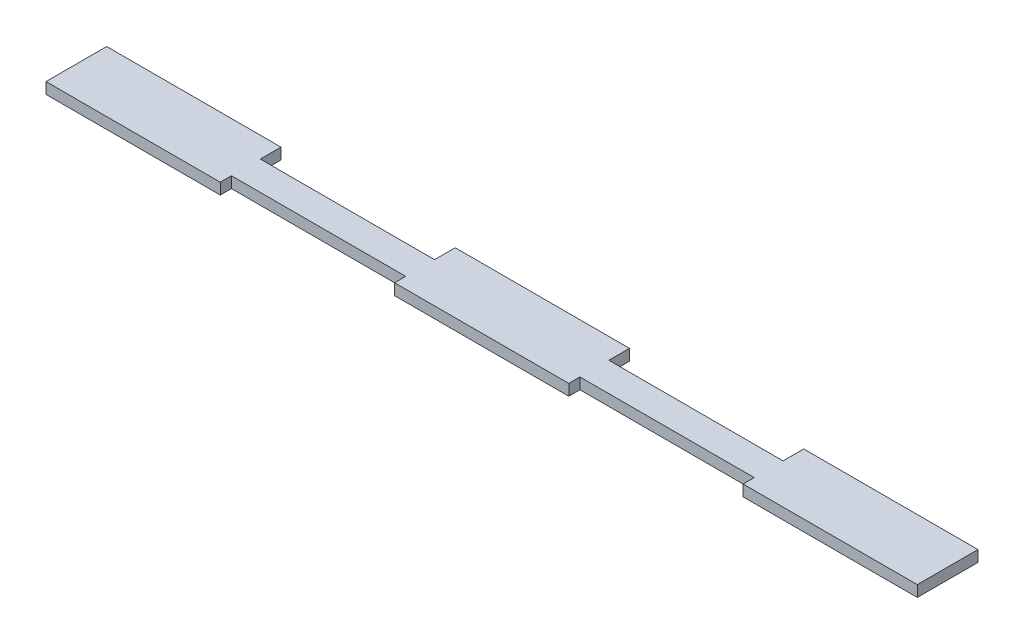
ISO-10303-21;
HEADER;
FILE_DESCRIPTION(('STEP AP214'),'2;1');
FILE_NAME('part.step','',(''),(''),'','','');
FILE_SCHEMA(('AUTOMOTIVE_DESIGN { 1 0 10303 214 1 1 1 1 }'));
ENDSEC;
DATA;
#1=APPLICATION_CONTEXT('core data for automotive mechanical design processes');
#2=APPLICATION_PROTOCOL_DEFINITION('international standard','automotive_design',2000,#1);
#3=PRODUCT_CONTEXT('',#1,'mechanical');
#4=PRODUCT('Part','Part','',(#3));
#5=PRODUCT_RELATED_PRODUCT_CATEGORY('part','',(#4));
#6=PRODUCT_DEFINITION_FORMATION('','',#4);
#7=PRODUCT_DEFINITION_CONTEXT('part definition',#1,'design');
#8=PRODUCT_DEFINITION('design','',#6,#7);
#9=PRODUCT_DEFINITION_SHAPE('','',#8);
#10=(LENGTH_UNIT() NAMED_UNIT(*) SI_UNIT(.MILLI.,.METRE.));
#11=(NAMED_UNIT(*) PLANE_ANGLE_UNIT() SI_UNIT($,.RADIAN.));
#12=(NAMED_UNIT(*) SI_UNIT($,.STERADIAN.) SOLID_ANGLE_UNIT());
#13=UNCERTAINTY_MEASURE_WITH_UNIT(LENGTH_MEASURE(1.E-05),#10,'distance_accuracy_value','');
#14=(GEOMETRIC_REPRESENTATION_CONTEXT(3) GLOBAL_UNCERTAINTY_ASSIGNED_CONTEXT((#13)) GLOBAL_UNIT_ASSIGNED_CONTEXT((#10,
#11,#12)) REPRESENTATION_CONTEXT('',''));
#15=CARTESIAN_POINT('',(0.,0.,0.));
#16=DIRECTION('',(0.,0.,1.));
#17=DIRECTION('',(1.,0.,0.));
#18=AXIS2_PLACEMENT_3D('',#15,#16,#17);
#19=CARTESIAN_POINT('',(63.3,2.7,6.01242319993023));
#20=DIRECTION('',(0.,0.,-1.));
#21=DIRECTION('',(-1.,0.,0.));
#22=AXIS2_PLACEMENT_3D('',#19,#20,#21);
#23=PLANE('',#22);
#24=DIRECTION('',(1.,0.,0.));
#25=VECTOR('',#24,1.);
#26=CARTESIAN_POINT('',(63.3,0.,6.01242319993023));
#27=LINE('',#26,#25);
#28=CARTESIAN_POINT('',(63.3,0.,6.01242319993023));
#29=VERTEX_POINT('',#28);
#30=CARTESIAN_POINT('',(105.5,0.,6.01242319993023));
#31=VERTEX_POINT('',#30);
#32=EDGE_CURVE('E201',#29,#31,#27,.T.);
#33=ORIENTED_EDGE('',*,*,#32,.T.);
#34=DIRECTION('',(0.,-1.,0.));
#35=VECTOR('',#34,1.);
#36=CARTESIAN_POINT('',(105.5,2.7,6.01242319993023));
#37=LINE('',#36,#35);
#38=CARTESIAN_POINT('',(105.5,2.7,6.01242319993023));
#39=VERTEX_POINT('',#38);
#40=EDGE_CURVE('E11',#39,#31,#37,.T.);
#41=ORIENTED_EDGE('',*,*,#40,.F.);
#42=DIRECTION('',(1.,0.,0.));
#43=VECTOR('',#42,1.);
#44=CARTESIAN_POINT('',(63.3,2.7,6.01242319993023));
#45=LINE('',#44,#43);
#46=CARTESIAN_POINT('',(63.3,2.7,6.01242319993023));
#47=VERTEX_POINT('',#46);
#48=EDGE_CURVE('E239',#47,#39,#45,.T.);
#49=ORIENTED_EDGE('',*,*,#48,.F.);
#50=DIRECTION('',(0.,-1.,0.));
#51=VECTOR('',#50,1.);
#52=CARTESIAN_POINT('',(63.3,2.7,6.01242319993023));
#53=LINE('',#52,#51);
#54=EDGE_CURVE('E197',#47,#29,#53,.T.);
#55=ORIENTED_EDGE('',*,*,#54,.T.);
#56=EDGE_LOOP('',(#33,#41,#49,#55));
#57=FACE_BOUND('',#56,.T.);
#58=ADVANCED_FACE('F33',(#57),#23,.F.);
#59=CARTESIAN_POINT('',(105.5,2.7,-8.68757680006977));
#60=DIRECTION('',(-1.,0.,0.));
#61=DIRECTION('',(0.,0.,1.));
#62=AXIS2_PLACEMENT_3D('',#59,#60,#61);
#63=PLANE('',#62);
#64=DIRECTION('',(0.,0.,-1.));
#65=VECTOR('',#64,1.);
#66=CARTESIAN_POINT('',(105.5,0.,-8.68757680006977));
#67=LINE('',#66,#65);
#68=CARTESIAN_POINT('',(105.5,0.,-8.68757680006977));
#69=VERTEX_POINT('',#68);
#70=EDGE_CURVE('E204',#31,#69,#67,.T.);
#71=ORIENTED_EDGE('',*,*,#70,.T.);
#72=DIRECTION('',(0.,-1.,0.));
#73=VECTOR('',#72,1.);
#74=CARTESIAN_POINT('',(105.5,2.7,-8.68757680006977));
#75=LINE('',#74,#73);
#76=CARTESIAN_POINT('',(105.5,2.7,-8.68757680006977));
#77=VERTEX_POINT('',#76);
#78=EDGE_CURVE('E41',#77,#69,#75,.T.);
#79=ORIENTED_EDGE('',*,*,#78,.F.);
#80=DIRECTION('',(0.,0.,-1.));
#81=VECTOR('',#80,1.);
#82=CARTESIAN_POINT('',(105.5,2.7,-8.68757680006977));
#83=LINE('',#82,#81);
#84=EDGE_CURVE('E128',#39,#77,#83,.T.);
#85=ORIENTED_EDGE('',*,*,#84,.F.);
#86=ORIENTED_EDGE('',*,*,#40,.T.);
#87=EDGE_LOOP('',(#71,#79,#85,#86));
#88=FACE_BOUND('',#87,.T.);
#89=ADVANCED_FACE('F357',(#88),#63,.F.);
#90=CARTESIAN_POINT('',(63.3,2.7,-8.68757680006977));
#91=DIRECTION('',(0.,0.,1.));
#92=DIRECTION('',(1.,0.,0.));
#93=AXIS2_PLACEMENT_3D('',#90,#91,#92);
#94=PLANE('',#93);
#95=DIRECTION('',(-1.,0.,0.));
#96=VECTOR('',#95,1.);
#97=CARTESIAN_POINT('',(63.3,0.,-8.68757680006977));
#98=LINE('',#97,#96);
#99=CARTESIAN_POINT('',(63.3,0.,-8.68757680006977));
#100=VERTEX_POINT('',#99);
#101=EDGE_CURVE('E206',#69,#100,#98,.T.);
#102=ORIENTED_EDGE('',*,*,#101,.T.);
#103=DIRECTION('',(0.,-1.,0.));
#104=VECTOR('',#103,1.);
#105=CARTESIAN_POINT('',(63.3,2.7,-8.68757680006977));
#106=LINE('',#105,#104);
#107=CARTESIAN_POINT('',(63.3,2.7,-8.68757680006977));
#108=VERTEX_POINT('',#107);
#109=EDGE_CURVE('E282',#108,#100,#106,.T.);
#110=ORIENTED_EDGE('',*,*,#109,.F.);
#111=DIRECTION('',(-1.,0.,0.));
#112=VECTOR('',#111,1.);
#113=CARTESIAN_POINT('',(63.3,2.7,-8.68757680006977));
#114=LINE('',#113,#112);
#115=EDGE_CURVE('E290',#77,#108,#114,.T.);
#116=ORIENTED_EDGE('',*,*,#115,.F.);
#117=ORIENTED_EDGE('',*,*,#78,.T.);
#118=EDGE_LOOP('',(#102,#110,#116,#117));
#119=FACE_BOUND('',#118,.T.);
#120=ADVANCED_FACE('F288',(#119),#94,.F.);
#121=CARTESIAN_POINT('',(63.3,2.7,-8.68757680006977));
#122=DIRECTION('',(1.,0.,0.));
#123=DIRECTION('',(0.,0.,-1.));
#124=AXIS2_PLACEMENT_3D('',#121,#122,#123);
#125=PLANE('',#124);
#126=DIRECTION('',(0.,0.,1.));
#127=VECTOR('',#126,1.);
#128=CARTESIAN_POINT('',(63.3,0.,-8.68757680006977));
#129=LINE('',#128,#127);
#130=CARTESIAN_POINT('',(63.3,0.,-3.68757680006977));
#131=VERTEX_POINT('',#130);
#132=EDGE_CURVE('E208',#100,#131,#129,.T.);
#133=ORIENTED_EDGE('',*,*,#132,.T.);
#134=DIRECTION('',(0.,-1.,0.));
#135=VECTOR('',#134,1.);
#136=CARTESIAN_POINT('',(63.3,2.7,-3.68757680006977));
#137=LINE('',#136,#135);
#138=CARTESIAN_POINT('',(63.3,2.7,-3.68757680006977));
#139=VERTEX_POINT('',#138);
#140=EDGE_CURVE('E279',#139,#131,#137,.T.);
#141=ORIENTED_EDGE('',*,*,#140,.F.);
#142=DIRECTION('',(0.,0.,1.));
#143=VECTOR('',#142,1.);
#144=CARTESIAN_POINT('',(63.3,2.7,-8.68757680006977));
#145=LINE('',#144,#143);
#146=EDGE_CURVE('E308',#108,#139,#145,.T.);
#147=ORIENTED_EDGE('',*,*,#146,.F.);
#148=ORIENTED_EDGE('',*,*,#109,.T.);
#149=EDGE_LOOP('',(#133,#141,#147,#148));
#150=FACE_BOUND('',#149,.T.);
#151=ADVANCED_FACE('F299',(#150),#125,.F.);
#152=CARTESIAN_POINT('',(21.1,2.7,-3.68757680006977));
#153=DIRECTION('',(0.,0.,1.));
#154=DIRECTION('',(1.,0.,0.));
#155=AXIS2_PLACEMENT_3D('',#152,#153,#154);
#156=PLANE('',#155);
#157=DIRECTION('',(-1.,0.,0.));
#158=VECTOR('',#157,1.);
#159=CARTESIAN_POINT('',(21.1,0.,-3.68757680006977));
#160=LINE('',#159,#158);
#161=CARTESIAN_POINT('',(21.1,0.,-3.68757680006977));
#162=VERTEX_POINT('',#161);
#163=EDGE_CURVE('E210',#131,#162,#160,.T.);
#164=ORIENTED_EDGE('',*,*,#163,.T.);
#165=DIRECTION('',(0.,-1.,0.));
#166=VECTOR('',#165,1.);
#167=CARTESIAN_POINT('',(21.1,2.7,-3.68757680006977));
#168=LINE('',#167,#166);
#169=CARTESIAN_POINT('',(21.1,2.7,-3.68757680006977));
#170=VERTEX_POINT('',#169);
#171=EDGE_CURVE('E276',#170,#162,#168,.T.);
#172=ORIENTED_EDGE('',*,*,#171,.F.);
#173=DIRECTION('',(-1.,0.,0.));
#174=VECTOR('',#173,1.);
#175=CARTESIAN_POINT('',(21.1,2.7,-3.68757680006977));
#176=LINE('',#175,#174);
#177=EDGE_CURVE('E305',#139,#170,#176,.T.);
#178=ORIENTED_EDGE('',*,*,#177,.F.);
#179=ORIENTED_EDGE('',*,*,#140,.T.);
#180=EDGE_LOOP('',(#164,#172,#178,#179));
#181=FACE_BOUND('',#180,.T.);
#182=ADVANCED_FACE('F303',(#181),#156,.F.);
#183=CARTESIAN_POINT('',(21.1,2.7,-8.68757680006977));
#184=DIRECTION('',(-1.,0.,0.));
#185=DIRECTION('',(0.,0.,1.));
#186=AXIS2_PLACEMENT_3D('',#183,#184,#185);
#187=PLANE('',#186);
#188=DIRECTION('',(0.,0.,-1.));
#189=VECTOR('',#188,1.);
#190=CARTESIAN_POINT('',(21.1,0.,-8.68757680006977));
#191=LINE('',#190,#189);
#192=CARTESIAN_POINT('',(21.1,0.,-8.68757680006977));
#193=VERTEX_POINT('',#192);
#194=EDGE_CURVE('E212',#162,#193,#191,.T.);
#195=ORIENTED_EDGE('',*,*,#194,.T.);
#196=DIRECTION('',(0.,-1.,0.));
#197=VECTOR('',#196,1.);
#198=CARTESIAN_POINT('',(21.1,2.7,-8.68757680006977));
#199=LINE('',#198,#197);
#200=CARTESIAN_POINT('',(21.1,2.7,-8.68757680006977));
#201=VERTEX_POINT('',#200);
#202=EDGE_CURVE('E273',#201,#193,#199,.T.);
#203=ORIENTED_EDGE('',*,*,#202,.F.);
#204=DIRECTION('',(0.,0.,-1.));
#205=VECTOR('',#204,1.);
#206=CARTESIAN_POINT('',(21.1,2.7,-8.68757680006977));
#207=LINE('',#206,#205);
#208=EDGE_CURVE('E307',#170,#201,#207,.T.);
#209=ORIENTED_EDGE('',*,*,#208,.F.);
#210=ORIENTED_EDGE('',*,*,#171,.T.);
#211=EDGE_LOOP('',(#195,#203,#209,#210));
#212=FACE_BOUND('',#211,.T.);
#213=ADVANCED_FACE('F370',(#212),#187,.F.);
#214=CARTESIAN_POINT('',(-21.1,2.7,-8.68757680006977));
#215=DIRECTION('',(0.,0.,1.));
#216=DIRECTION('',(1.,0.,0.));
#217=AXIS2_PLACEMENT_3D('',#214,#215,#216);
#218=PLANE('',#217);
#219=DIRECTION('',(-1.,0.,0.));
#220=VECTOR('',#219,1.);
#221=CARTESIAN_POINT('',(-21.1,0.,-8.68757680006977));
#222=LINE('',#221,#220);
#223=CARTESIAN_POINT('',(-21.1,0.,-8.68757680006977));
#224=VERTEX_POINT('',#223);
#225=EDGE_CURVE('E214',#193,#224,#222,.T.);
#226=ORIENTED_EDGE('',*,*,#225,.T.);
#227=DIRECTION('',(0.,-1.,0.));
#228=VECTOR('',#227,1.);
#229=CARTESIAN_POINT('',(-21.1,2.7,-8.68757680006977));
#230=LINE('',#229,#228);
#231=CARTESIAN_POINT('',(-21.1,2.7,-8.68757680006977));
#232=VERTEX_POINT('',#231);
#233=EDGE_CURVE('E270',#232,#224,#230,.T.);
#234=ORIENTED_EDGE('',*,*,#233,.F.);
#235=DIRECTION('',(-1.,0.,0.));
#236=VECTOR('',#235,1.);
#237=CARTESIAN_POINT('',(-21.1,2.7,-8.68757680006977));
#238=LINE('',#237,#236);
#239=EDGE_CURVE('E310',#201,#232,#238,.T.);
#240=ORIENTED_EDGE('',*,*,#239,.F.);
#241=ORIENTED_EDGE('',*,*,#202,.T.);
#242=EDGE_LOOP('',(#226,#234,#240,#241));
#243=FACE_BOUND('',#242,.T.);
#244=ADVANCED_FACE('F373',(#243),#218,.F.);
#245=CARTESIAN_POINT('',(-21.1,2.7,-8.68757680006977));
#246=DIRECTION('',(1.,0.,0.));
#247=DIRECTION('',(0.,0.,-1.));
#248=AXIS2_PLACEMENT_3D('',#245,#246,#247);
#249=PLANE('',#248);
#250=DIRECTION('',(0.,0.,1.));
#251=VECTOR('',#250,1.);
#252=CARTESIAN_POINT('',(-21.1,0.,-8.68757680006977));
#253=LINE('',#252,#251);
#254=CARTESIAN_POINT('',(-21.1,0.,-3.68757680006977));
#255=VERTEX_POINT('',#254);
#256=EDGE_CURVE('E216',#224,#255,#253,.T.);
#257=ORIENTED_EDGE('',*,*,#256,.T.);
#258=DIRECTION('',(0.,-1.,0.));
#259=VECTOR('',#258,1.);
#260=CARTESIAN_POINT('',(-21.1,2.7,-3.68757680006977));
#261=LINE('',#260,#259);
#262=CARTESIAN_POINT('',(-21.1,2.7,-3.68757680006977));
#263=VERTEX_POINT('',#262);
#264=EDGE_CURVE('E267',#263,#255,#261,.T.);
#265=ORIENTED_EDGE('',*,*,#264,.F.);
#266=DIRECTION('',(0.,0.,1.));
#267=VECTOR('',#266,1.);
#268=CARTESIAN_POINT('',(-21.1,2.7,-8.68757680006977));
#269=LINE('',#268,#267);
#270=EDGE_CURVE('E316',#232,#263,#269,.T.);
#271=ORIENTED_EDGE('',*,*,#270,.F.);
#272=ORIENTED_EDGE('',*,*,#233,.T.);
#273=EDGE_LOOP('',(#257,#265,#271,#272));
#274=FACE_BOUND('',#273,.T.);
#275=ADVANCED_FACE('F377',(#274),#249,.F.);
#276=CARTESIAN_POINT('',(-63.3,2.7,-3.68757680006977));
#277=DIRECTION('',(0.,0.,1.));
#278=DIRECTION('',(1.,0.,0.));
#279=AXIS2_PLACEMENT_3D('',#276,#277,#278);
#280=PLANE('',#279);
#281=DIRECTION('',(-1.,0.,0.));
#282=VECTOR('',#281,1.);
#283=CARTESIAN_POINT('',(-63.3,0.,-3.68757680006977));
#284=LINE('',#283,#282);
#285=CARTESIAN_POINT('',(-63.3,0.,-3.68757680006977));
#286=VERTEX_POINT('',#285);
#287=EDGE_CURVE('E218',#255,#286,#284,.T.);
#288=ORIENTED_EDGE('',*,*,#287,.T.);
#289=DIRECTION('',(0.,-1.,0.));
#290=VECTOR('',#289,1.);
#291=CARTESIAN_POINT('',(-63.3,2.7,-3.68757680006977));
#292=LINE('',#291,#290);
#293=CARTESIAN_POINT('',(-63.3,2.7,-3.68757680006977));
#294=VERTEX_POINT('',#293);
#295=EDGE_CURVE('E264',#294,#286,#292,.T.);
#296=ORIENTED_EDGE('',*,*,#295,.F.);
#297=DIRECTION('',(-1.,0.,0.));
#298=VECTOR('',#297,1.);
#299=CARTESIAN_POINT('',(-63.3,2.7,-3.68757680006977));
#300=LINE('',#299,#298);
#301=EDGE_CURVE('E318',#263,#294,#300,.T.);
#302=ORIENTED_EDGE('',*,*,#301,.F.);
#303=ORIENTED_EDGE('',*,*,#264,.T.);
#304=EDGE_LOOP('',(#288,#296,#302,#303));
#305=FACE_BOUND('',#304,.T.);
#306=ADVANCED_FACE('F381',(#305),#280,.F.);
#307=CARTESIAN_POINT('',(-63.3,2.7,-8.68757680006977));
#308=DIRECTION('',(-1.,0.,0.));
#309=DIRECTION('',(0.,0.,1.));
#310=AXIS2_PLACEMENT_3D('',#307,#308,#309);
#311=PLANE('',#310);
#312=DIRECTION('',(0.,0.,-1.));
#313=VECTOR('',#312,1.);
#314=CARTESIAN_POINT('',(-63.3,0.,-8.68757680006977));
#315=LINE('',#314,#313);
#316=CARTESIAN_POINT('',(-63.3,0.,-8.68757680006977));
#317=VERTEX_POINT('',#316);
#318=EDGE_CURVE('E220',#286,#317,#315,.T.);
#319=ORIENTED_EDGE('',*,*,#318,.T.);
#320=DIRECTION('',(0.,-1.,0.));
#321=VECTOR('',#320,1.);
#322=CARTESIAN_POINT('',(-63.3,2.7,-8.68757680006977));
#323=LINE('',#322,#321);
#324=CARTESIAN_POINT('',(-63.3,2.7,-8.68757680006977));
#325=VERTEX_POINT('',#324);
#326=EDGE_CURVE('E261',#325,#317,#323,.T.);
#327=ORIENTED_EDGE('',*,*,#326,.F.);
#328=DIRECTION('',(0.,0.,-1.));
#329=VECTOR('',#328,1.);
#330=CARTESIAN_POINT('',(-63.3,2.7,-8.68757680006977));
#331=LINE('',#330,#329);
#332=EDGE_CURVE('E320',#294,#325,#331,.T.);
#333=ORIENTED_EDGE('',*,*,#332,.F.);
#334=ORIENTED_EDGE('',*,*,#295,.T.);
#335=EDGE_LOOP('',(#319,#327,#333,#334));
#336=FACE_BOUND('',#335,.T.);
#337=ADVANCED_FACE('F385',(#336),#311,.F.);
#338=CARTESIAN_POINT('',(-105.5,2.7,-8.68757680006977));
#339=DIRECTION('',(0.,0.,1.));
#340=DIRECTION('',(1.,0.,0.));
#341=AXIS2_PLACEMENT_3D('',#338,#339,#340);
#342=PLANE('',#341);
#343=DIRECTION('',(-1.,0.,0.));
#344=VECTOR('',#343,1.);
#345=CARTESIAN_POINT('',(-105.5,0.,-8.68757680006977));
#346=LINE('',#345,#344);
#347=CARTESIAN_POINT('',(-105.5,0.,-8.68757680006977));
#348=VERTEX_POINT('',#347);
#349=EDGE_CURVE('E222',#317,#348,#346,.T.);
#350=ORIENTED_EDGE('',*,*,#349,.T.);
#351=DIRECTION('',(0.,-1.,0.));
#352=VECTOR('',#351,1.);
#353=CARTESIAN_POINT('',(-105.5,2.7,-8.68757680006977));
#354=LINE('',#353,#352);
#355=CARTESIAN_POINT('',(-105.5,2.7,-8.68757680006977));
#356=VERTEX_POINT('',#355);
#357=EDGE_CURVE('E258',#356,#348,#354,.T.);
#358=ORIENTED_EDGE('',*,*,#357,.F.);
#359=DIRECTION('',(-1.,0.,0.));
#360=VECTOR('',#359,1.);
#361=CARTESIAN_POINT('',(-105.5,2.7,-8.68757680006977));
#362=LINE('',#361,#360);
#363=EDGE_CURVE('E322',#325,#356,#362,.T.);
#364=ORIENTED_EDGE('',*,*,#363,.F.);
#365=ORIENTED_EDGE('',*,*,#326,.T.);
#366=EDGE_LOOP('',(#350,#358,#364,#365));
#367=FACE_BOUND('',#366,.T.);
#368=ADVANCED_FACE('F389',(#367),#342,.F.);
#369=CARTESIAN_POINT('',(-105.5,2.7,-8.68757680006977));
#370=DIRECTION('',(1.,0.,0.));
#371=DIRECTION('',(0.,0.,-1.));
#372=AXIS2_PLACEMENT_3D('',#369,#370,#371);
#373=PLANE('',#372);
#374=DIRECTION('',(0.,0.,1.));
#375=VECTOR('',#374,1.);
#376=CARTESIAN_POINT('',(-105.5,0.,-8.68757680006977));
#377=LINE('',#376,#375);
#378=CARTESIAN_POINT('',(-105.5,0.,6.01242319993023));
#379=VERTEX_POINT('',#378);
#380=EDGE_CURVE('E224',#348,#379,#377,.T.);
#381=ORIENTED_EDGE('',*,*,#380,.T.);
#382=DIRECTION('',(0.,-1.,0.));
#383=VECTOR('',#382,1.);
#384=CARTESIAN_POINT('',(-105.5,2.7,6.01242319993023));
#385=LINE('',#384,#383);
#386=CARTESIAN_POINT('',(-105.5,2.7,6.01242319993023));
#387=VERTEX_POINT('',#386);
#388=EDGE_CURVE('E255',#387,#379,#385,.T.);
#389=ORIENTED_EDGE('',*,*,#388,.F.);
#390=DIRECTION('',(0.,0.,1.));
#391=VECTOR('',#390,1.);
#392=CARTESIAN_POINT('',(-105.5,2.7,-8.68757680006977));
#393=LINE('',#392,#391);
#394=EDGE_CURVE('E324',#356,#387,#393,.T.);
#395=ORIENTED_EDGE('',*,*,#394,.F.);
#396=ORIENTED_EDGE('',*,*,#357,.T.);
#397=EDGE_LOOP('',(#381,#389,#395,#396));
#398=FACE_BOUND('',#397,.T.);
#399=ADVANCED_FACE('F393',(#398),#373,.F.);
#400=CARTESIAN_POINT('',(-105.5,2.7,6.01242319993023));
#401=DIRECTION('',(0.,0.,-1.));
#402=DIRECTION('',(-1.,0.,0.));
#403=AXIS2_PLACEMENT_3D('',#400,#401,#402);
#404=PLANE('',#403);
#405=DIRECTION('',(1.,0.,0.));
#406=VECTOR('',#405,1.);
#407=CARTESIAN_POINT('',(-105.5,0.,6.01242319993023));
#408=LINE('',#407,#406);
#409=CARTESIAN_POINT('',(-63.3,0.,6.01242319993023));
#410=VERTEX_POINT('',#409);
#411=EDGE_CURVE('E226',#379,#410,#408,.T.);
#412=ORIENTED_EDGE('',*,*,#411,.T.);
#413=DIRECTION('',(0.,-1.,0.));
#414=VECTOR('',#413,1.);
#415=CARTESIAN_POINT('',(-63.3,2.7,6.01242319993023));
#416=LINE('',#415,#414);
#417=CARTESIAN_POINT('',(-63.3,2.7,6.01242319993023));
#418=VERTEX_POINT('',#417);
#419=EDGE_CURVE('E252',#418,#410,#416,.T.);
#420=ORIENTED_EDGE('',*,*,#419,.F.);
#421=DIRECTION('',(1.,0.,0.));
#422=VECTOR('',#421,1.);
#423=CARTESIAN_POINT('',(-105.5,2.7,6.01242319993023));
#424=LINE('',#423,#422);
#425=EDGE_CURVE('E326',#387,#418,#424,.T.);
#426=ORIENTED_EDGE('',*,*,#425,.F.);
#427=ORIENTED_EDGE('',*,*,#388,.T.);
#428=EDGE_LOOP('',(#412,#420,#426,#427));
#429=FACE_BOUND('',#428,.T.);
#430=ADVANCED_FACE('F397',(#429),#404,.F.);
#431=CARTESIAN_POINT('',(-63.3,2.7,6.01242319993023));
#432=DIRECTION('',(-1.,0.,0.));
#433=DIRECTION('',(0.,0.,1.));
#434=AXIS2_PLACEMENT_3D('',#431,#432,#433);
#435=PLANE('',#434);
#436=DIRECTION('',(0.,0.,-1.));
#437=VECTOR('',#436,1.);
#438=CARTESIAN_POINT('',(-63.3,0.,6.01242319993023));
#439=LINE('',#438,#437);
#440=CARTESIAN_POINT('',(-63.3,0.,3.31242319993023));
#441=VERTEX_POINT('',#440);
#442=EDGE_CURVE('E228',#410,#441,#439,.T.);
#443=ORIENTED_EDGE('',*,*,#442,.T.);
#444=DIRECTION('',(0.,-1.,0.));
#445=VECTOR('',#444,1.);
#446=CARTESIAN_POINT('',(-63.3,2.7,3.31242319993023));
#447=LINE('',#446,#445);
#448=CARTESIAN_POINT('',(-63.3,2.7,3.31242319993023));
#449=VERTEX_POINT('',#448);
#450=EDGE_CURVE('E249',#449,#441,#447,.T.);
#451=ORIENTED_EDGE('',*,*,#450,.F.);
#452=DIRECTION('',(0.,0.,-1.));
#453=VECTOR('',#452,1.);
#454=CARTESIAN_POINT('',(-63.3,2.7,6.01242319993023));
#455=LINE('',#454,#453);
#456=EDGE_CURVE('E328',#418,#449,#455,.T.);
#457=ORIENTED_EDGE('',*,*,#456,.F.);
#458=ORIENTED_EDGE('',*,*,#419,.T.);
#459=EDGE_LOOP('',(#443,#451,#457,#458));
#460=FACE_BOUND('',#459,.T.);
#461=ADVANCED_FACE('F401',(#460),#435,.F.);
#462=CARTESIAN_POINT('',(-63.3,2.7,3.31242319993023));
#463=DIRECTION('',(0.,0.,-1.));
#464=DIRECTION('',(-1.,0.,0.));
#465=AXIS2_PLACEMENT_3D('',#462,#463,#464);
#466=PLANE('',#465);
#467=DIRECTION('',(1.,0.,0.));
#468=VECTOR('',#467,1.);
#469=CARTESIAN_POINT('',(-63.3,0.,3.31242319993023));
#470=LINE('',#469,#468);
#471=CARTESIAN_POINT('',(-21.1,0.,3.31242319993023));
#472=VERTEX_POINT('',#471);
#473=EDGE_CURVE('E230',#441,#472,#470,.T.);
#474=ORIENTED_EDGE('',*,*,#473,.T.);
#475=DIRECTION('',(0.,-1.,0.));
#476=VECTOR('',#475,1.);
#477=CARTESIAN_POINT('',(-21.1,2.7,3.31242319993023));
#478=LINE('',#477,#476);
#479=CARTESIAN_POINT('',(-21.1,2.7,3.31242319993023));
#480=VERTEX_POINT('',#479);
#481=EDGE_CURVE('E246',#480,#472,#478,.T.);
#482=ORIENTED_EDGE('',*,*,#481,.F.);
#483=DIRECTION('',(1.,0.,0.));
#484=VECTOR('',#483,1.);
#485=CARTESIAN_POINT('',(-63.3,2.7,3.31242319993023));
#486=LINE('',#485,#484);
#487=EDGE_CURVE('E330',#449,#480,#486,.T.);
#488=ORIENTED_EDGE('',*,*,#487,.F.);
#489=ORIENTED_EDGE('',*,*,#450,.T.);
#490=EDGE_LOOP('',(#474,#482,#488,#489));
#491=FACE_BOUND('',#490,.T.);
#492=ADVANCED_FACE('F405',(#491),#466,.F.);
#493=CARTESIAN_POINT('',(-21.1,2.7,6.01242319993023));
#494=DIRECTION('',(1.,0.,0.));
#495=DIRECTION('',(0.,0.,-1.));
#496=AXIS2_PLACEMENT_3D('',#493,#494,#495);
#497=PLANE('',#496);
#498=DIRECTION('',(0.,0.,1.));
#499=VECTOR('',#498,1.);
#500=CARTESIAN_POINT('',(-21.1,0.,6.01242319993023));
#501=LINE('',#500,#499);
#502=CARTESIAN_POINT('',(-21.1,0.,6.01242319993023));
#503=VERTEX_POINT('',#502);
#504=EDGE_CURVE('E232',#472,#503,#501,.T.);
#505=ORIENTED_EDGE('',*,*,#504,.T.);
#506=DIRECTION('',(0.,-1.,0.));
#507=VECTOR('',#506,1.);
#508=CARTESIAN_POINT('',(-21.1,2.7,6.01242319993023));
#509=LINE('',#508,#507);
#510=CARTESIAN_POINT('',(-21.1,2.7,6.01242319993023));
#511=VERTEX_POINT('',#510);
#512=EDGE_CURVE('E243',#511,#503,#509,.T.);
#513=ORIENTED_EDGE('',*,*,#512,.F.);
#514=DIRECTION('',(0.,0.,1.));
#515=VECTOR('',#514,1.);
#516=CARTESIAN_POINT('',(-21.1,2.7,6.01242319993023));
#517=LINE('',#516,#515);
#518=EDGE_CURVE('E332',#480,#511,#517,.T.);
#519=ORIENTED_EDGE('',*,*,#518,.F.);
#520=ORIENTED_EDGE('',*,*,#481,.T.);
#521=EDGE_LOOP('',(#505,#513,#519,#520));
#522=FACE_BOUND('',#521,.T.);
#523=ADVANCED_FACE('F338',(#522),#497,.F.);
#524=CARTESIAN_POINT('',(-21.1,2.7,6.01242319993023));
#525=DIRECTION('',(0.,0.,-1.));
#526=DIRECTION('',(-1.,0.,0.));
#527=AXIS2_PLACEMENT_3D('',#524,#525,#526);
#528=PLANE('',#527);
#529=DIRECTION('',(1.,0.,0.));
#530=VECTOR('',#529,1.);
#531=CARTESIAN_POINT('',(-21.1,0.,6.01242319993023));
#532=LINE('',#531,#530);
#533=CARTESIAN_POINT('',(21.1,0.,6.01242319993023));
#534=VERTEX_POINT('',#533);
#535=EDGE_CURVE('E234',#503,#534,#532,.T.);
#536=ORIENTED_EDGE('',*,*,#535,.T.);
#537=DIRECTION('',(0.,-1.,0.));
#538=VECTOR('',#537,1.);
#539=CARTESIAN_POINT('',(21.1,2.7,6.01242319993023));
#540=LINE('',#539,#538);
#541=CARTESIAN_POINT('',(21.1,2.7,6.01242319993023));
#542=VERTEX_POINT('',#541);
#543=EDGE_CURVE('E192',#542,#534,#540,.T.);
#544=ORIENTED_EDGE('',*,*,#543,.F.);
#545=DIRECTION('',(1.,0.,0.));
#546=VECTOR('',#545,1.);
#547=CARTESIAN_POINT('',(-21.1,2.7,6.01242319993023));
#548=LINE('',#547,#546);
#549=EDGE_CURVE('E183',#511,#542,#548,.T.);
#550=ORIENTED_EDGE('',*,*,#549,.F.);
#551=ORIENTED_EDGE('',*,*,#512,.T.);
#552=EDGE_LOOP('',(#536,#544,#550,#551));
#553=FACE_BOUND('',#552,.T.);
#554=ADVANCED_FACE('F342',(#553),#528,.F.);
#555=CARTESIAN_POINT('',(21.1,2.7,6.01242319993023));
#556=DIRECTION('',(-1.,0.,0.));
#557=DIRECTION('',(0.,0.,1.));
#558=AXIS2_PLACEMENT_3D('',#555,#556,#557);
#559=PLANE('',#558);
#560=DIRECTION('',(0.,0.,-1.));
#561=VECTOR('',#560,1.);
#562=CARTESIAN_POINT('',(21.1,0.,6.01242319993023));
#563=LINE('',#562,#561);
#564=CARTESIAN_POINT('',(21.1,0.,3.31242319993023));
#565=VERTEX_POINT('',#564);
#566=EDGE_CURVE('E191',#534,#565,#563,.T.);
#567=ORIENTED_EDGE('',*,*,#566,.T.);
#568=DIRECTION('',(0.,-1.,0.));
#569=VECTOR('',#568,1.);
#570=CARTESIAN_POINT('',(21.1,2.7,3.31242319993023));
#571=LINE('',#570,#569);
#572=CARTESIAN_POINT('',(21.1,2.7,3.31242319993023));
#573=VERTEX_POINT('',#572);
#574=EDGE_CURVE('E188',#573,#565,#571,.T.);
#575=ORIENTED_EDGE('',*,*,#574,.F.);
#576=DIRECTION('',(0.,0.,-1.));
#577=VECTOR('',#576,1.);
#578=CARTESIAN_POINT('',(21.1,2.7,6.01242319993023));
#579=LINE('',#578,#577);
#580=EDGE_CURVE('E177',#542,#573,#579,.T.);
#581=ORIENTED_EDGE('',*,*,#580,.F.);
#582=ORIENTED_EDGE('',*,*,#543,.T.);
#583=EDGE_LOOP('',(#567,#575,#581,#582));
#584=FACE_BOUND('',#583,.T.);
#585=ADVANCED_FACE('F189',(#584),#559,.F.);
#586=CARTESIAN_POINT('',(21.1,2.7,3.31242319993023));
#587=DIRECTION('',(0.,0.,-1.));
#588=DIRECTION('',(-1.,0.,0.));
#589=AXIS2_PLACEMENT_3D('',#586,#587,#588);
#590=PLANE('',#589);
#591=DIRECTION('',(1.,0.,0.));
#592=VECTOR('',#591,1.);
#593=CARTESIAN_POINT('',(21.1,0.,3.31242319993023));
#594=LINE('',#593,#592);
#595=CARTESIAN_POINT('',(63.3,0.,3.31242319993023));
#596=VERTEX_POINT('',#595);
#597=EDGE_CURVE('E114',#565,#596,#594,.T.);
#598=ORIENTED_EDGE('',*,*,#597,.T.);
#599=DIRECTION('',(0.,-1.,0.));
#600=VECTOR('',#599,1.);
#601=CARTESIAN_POINT('',(63.3,2.7,3.31242319993023));
#602=LINE('',#601,#600);
#603=CARTESIAN_POINT('',(63.3,2.7,3.31242319993023));
#604=VERTEX_POINT('',#603);
#605=EDGE_CURVE('E193',#604,#596,#602,.T.);
#606=ORIENTED_EDGE('',*,*,#605,.F.);
#607=DIRECTION('',(1.,0.,0.));
#608=VECTOR('',#607,1.);
#609=CARTESIAN_POINT('',(21.1,2.7,3.31242319993023));
#610=LINE('',#609,#608);
#611=EDGE_CURVE('E181',#573,#604,#610,.T.);
#612=ORIENTED_EDGE('',*,*,#611,.F.);
#613=ORIENTED_EDGE('',*,*,#574,.T.);
#614=EDGE_LOOP('',(#598,#606,#612,#613));
#615=FACE_BOUND('',#614,.T.);
#616=ADVANCED_FACE('F195',(#615),#590,.F.);
#617=CARTESIAN_POINT('',(63.3,2.7,6.01242319993023));
#618=DIRECTION('',(1.,0.,0.));
#619=DIRECTION('',(0.,0.,-1.));
#620=AXIS2_PLACEMENT_3D('',#617,#618,#619);
#621=PLANE('',#620);
#622=DIRECTION('',(0.,0.,1.));
#623=VECTOR('',#622,1.);
#624=CARTESIAN_POINT('',(63.3,0.,6.01242319993023));
#625=LINE('',#624,#623);
#626=EDGE_CURVE('E120',#596,#29,#625,.T.);
#627=ORIENTED_EDGE('',*,*,#626,.T.);
#628=ORIENTED_EDGE('',*,*,#54,.F.);
#629=DIRECTION('',(0.,0.,1.));
#630=VECTOR('',#629,1.);
#631=CARTESIAN_POINT('',(63.3,2.7,6.01242319993023));
#632=LINE('',#631,#630);
#633=EDGE_CURVE('E49',#604,#47,#632,.T.);
#634=ORIENTED_EDGE('',*,*,#633,.F.);
#635=ORIENTED_EDGE('',*,*,#605,.T.);
#636=EDGE_LOOP('',(#627,#628,#634,#635));
#637=FACE_BOUND('',#636,.T.);
#638=ADVANCED_FACE('F346',(#637),#621,.F.);
#639=CARTESIAN_POINT('',(0.,2.7,0.));
#640=DIRECTION('',(0.,-1.,0.));
#641=DIRECTION('',(0.,0.,-1.));
#642=AXIS2_PLACEMENT_3D('',#639,#640,#641);
#643=PLANE('',#642);
#644=ORIENTED_EDGE('',*,*,#48,.T.);
#645=ORIENTED_EDGE('',*,*,#84,.T.);
#646=ORIENTED_EDGE('',*,*,#115,.T.);
#647=ORIENTED_EDGE('',*,*,#146,.T.);
#648=ORIENTED_EDGE('',*,*,#177,.T.);
#649=ORIENTED_EDGE('',*,*,#208,.T.);
#650=ORIENTED_EDGE('',*,*,#239,.T.);
#651=ORIENTED_EDGE('',*,*,#270,.T.);
#652=ORIENTED_EDGE('',*,*,#301,.T.);
#653=ORIENTED_EDGE('',*,*,#332,.T.);
#654=ORIENTED_EDGE('',*,*,#363,.T.);
#655=ORIENTED_EDGE('',*,*,#394,.T.);
#656=ORIENTED_EDGE('',*,*,#425,.T.);
#657=ORIENTED_EDGE('',*,*,#456,.T.);
#658=ORIENTED_EDGE('',*,*,#487,.T.);
#659=ORIENTED_EDGE('',*,*,#518,.T.);
#660=ORIENTED_EDGE('',*,*,#549,.T.);
#661=ORIENTED_EDGE('',*,*,#580,.T.);
#662=ORIENTED_EDGE('',*,*,#611,.T.);
#663=ORIENTED_EDGE('',*,*,#633,.T.);
#664=EDGE_LOOP('',(#644,#645,#646,#647,#648,#649,#650,#651,#652,#653,#654,#655,#656,#657,#658,
#659,#660,#661,#662,#663));
#665=FACE_BOUND('',#664,.T.);
#666=ADVANCED_FACE('F179',(#665),#643,.F.);
#667=CARTESIAN_POINT('',(0.,0.,0.));
#668=DIRECTION('',(0.,-1.,0.));
#669=DIRECTION('',(0.,0.,-1.));
#670=AXIS2_PLACEMENT_3D('',#667,#668,#669);
#671=PLANE('',#670);
#672=ORIENTED_EDGE('',*,*,#32,.F.);
#673=ORIENTED_EDGE('',*,*,#626,.F.);
#674=ORIENTED_EDGE('',*,*,#597,.F.);
#675=ORIENTED_EDGE('',*,*,#566,.F.);
#676=ORIENTED_EDGE('',*,*,#535,.F.);
#677=ORIENTED_EDGE('',*,*,#504,.F.);
#678=ORIENTED_EDGE('',*,*,#473,.F.);
#679=ORIENTED_EDGE('',*,*,#442,.F.);
#680=ORIENTED_EDGE('',*,*,#411,.F.);
#681=ORIENTED_EDGE('',*,*,#380,.F.);
#682=ORIENTED_EDGE('',*,*,#349,.F.);
#683=ORIENTED_EDGE('',*,*,#318,.F.);
#684=ORIENTED_EDGE('',*,*,#287,.F.);
#685=ORIENTED_EDGE('',*,*,#256,.F.);
#686=ORIENTED_EDGE('',*,*,#225,.F.);
#687=ORIENTED_EDGE('',*,*,#194,.F.);
#688=ORIENTED_EDGE('',*,*,#163,.F.);
#689=ORIENTED_EDGE('',*,*,#132,.F.);
#690=ORIENTED_EDGE('',*,*,#101,.F.);
#691=ORIENTED_EDGE('',*,*,#70,.F.);
#692=EDGE_LOOP('',(#672,#673,#674,#675,#676,#677,#678,#679,#680,#681,#682,#683,#684,#685,#686,
#687,#688,#689,#690,#691));
#693=FACE_BOUND('',#692,.T.);
#694=ADVANCED_FACE('F294',(#693),#671,.T.);
#695=CLOSED_SHELL('',(#58,#89,#120,#151,#182,#213,#244,#275,#306,#337,#368,#399,#430,#461,#492,
#523,#554,#585,#616,#638,#666,#694));
#696=MANIFOLD_SOLID_BREP('B2',#695);
#697=ADVANCED_BREP_SHAPE_REPRESENTATION('',(#18,#696),#14);
#698=SHAPE_DEFINITION_REPRESENTATION(#9,#697);
ENDSEC;
END-ISO-10303-21;
